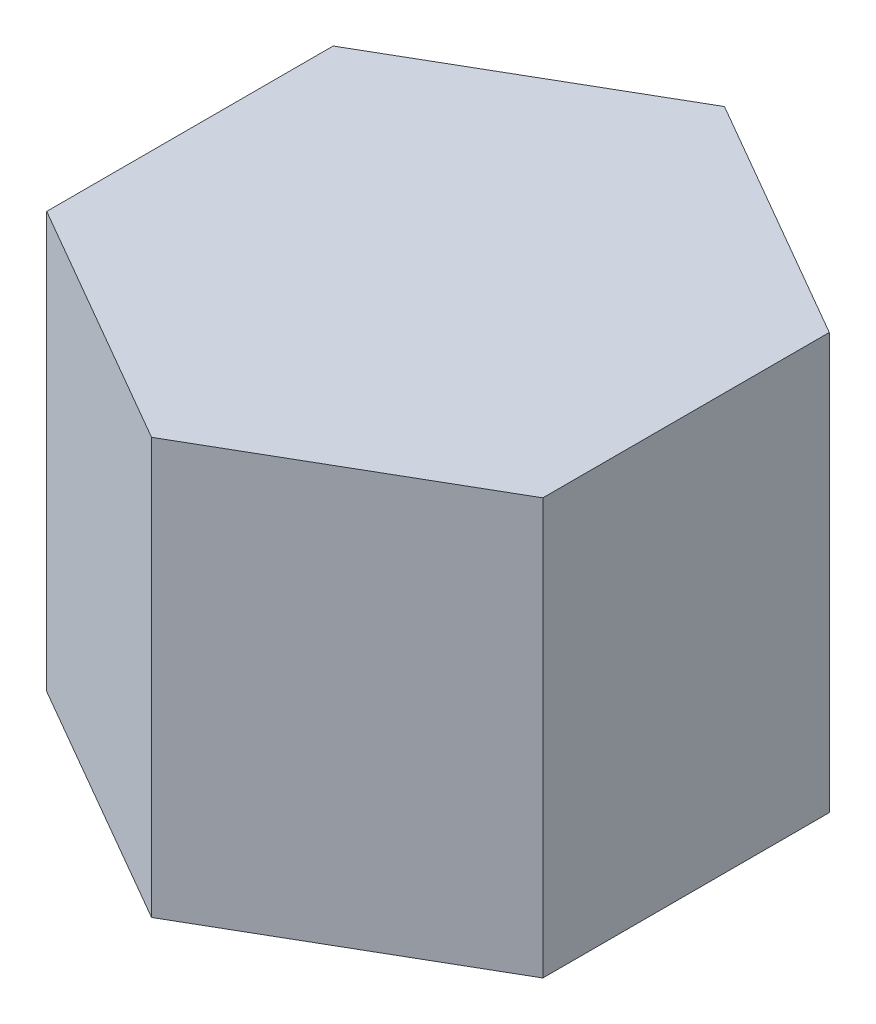
ISO-10303-21;
HEADER;
FILE_DESCRIPTION(('STEP AP214'),'2;1');
FILE_NAME('part.step','',(''),(''),'','','');
FILE_SCHEMA(('AUTOMOTIVE_DESIGN { 1 0 10303 214 1 1 1 1 }'));
ENDSEC;
DATA;
#1=APPLICATION_CONTEXT('core data for automotive mechanical design processes');
#2=APPLICATION_PROTOCOL_DEFINITION('international standard','automotive_design',2000,#1);
#3=PRODUCT_CONTEXT('',#1,'mechanical');
#4=PRODUCT('Part','Part','',(#3));
#5=PRODUCT_RELATED_PRODUCT_CATEGORY('part','',(#4));
#6=PRODUCT_DEFINITION_FORMATION('','',#4);
#7=PRODUCT_DEFINITION_CONTEXT('part definition',#1,'design');
#8=PRODUCT_DEFINITION('design','',#6,#7);
#9=PRODUCT_DEFINITION_SHAPE('','',#8);
#10=(LENGTH_UNIT() NAMED_UNIT(*) SI_UNIT(.MILLI.,.METRE.));
#11=(NAMED_UNIT(*) PLANE_ANGLE_UNIT() SI_UNIT($,.RADIAN.));
#12=(NAMED_UNIT(*) SI_UNIT($,.STERADIAN.) SOLID_ANGLE_UNIT());
#13=UNCERTAINTY_MEASURE_WITH_UNIT(LENGTH_MEASURE(1.E-05),#10,'distance_accuracy_value','');
#14=(GEOMETRIC_REPRESENTATION_CONTEXT(3) GLOBAL_UNCERTAINTY_ASSIGNED_CONTEXT((#13)) GLOBAL_UNIT_ASSIGNED_CONTEXT((#10,
#11,#12)) REPRESENTATION_CONTEXT('',''));
#15=CARTESIAN_POINT('',(0.,0.,0.));
#16=DIRECTION('',(0.,0.,1.));
#17=DIRECTION('',(1.,0.,0.));
#18=AXIS2_PLACEMENT_3D('',#15,#16,#17);
#19=CARTESIAN_POINT('',(208.642660308706,-148.537700895744,291.506971220494));
#20=DIRECTION('',(-0.499999999999909,0.,-0.866025403784491));
#21=DIRECTION('',(-0.866025403784491,0.,0.499999999999909));
#22=AXIS2_PLACEMENT_3D('',#19,#20,#21);
#23=PLANE('',#22);
#24=CARTESIAN_POINT('',(208.339551417382,-149.045793579175,291.681971220494));
#25=DIRECTION('',(0.866025403784491,0.,-0.499999999999909));
#26=VECTOR('',#25,1.);
#27=LINE('',#24,#26);
#28=CARTESIAN_POINT('',(208.339551417382,-149.045793579175,291.681971220494));
#29=VERTEX_POINT('',#28);
#30=CARTESIAN_POINT('',(208.642660308706,-149.045793579175,291.506971220494));
#31=VERTEX_POINT('',#30);
#32=EDGE_CURVE('E170',#29,#31,#27,.T.);
#33=ORIENTED_EDGE('',*,*,#32,.T.);
#34=CARTESIAN_POINT('',(208.642660308706,-148.537700895744,291.506971220494));
#35=DIRECTION('',(0.,-1.,0.));
#36=VECTOR('',#35,1.);
#37=LINE('',#34,#36);
#38=CARTESIAN_POINT('',(208.642660308706,-148.537700895744,291.506971220494));
#39=VERTEX_POINT('',#38);
#40=EDGE_CURVE('E35',#39,#31,#37,.T.);
#41=ORIENTED_EDGE('',*,*,#40,.F.);
#42=CARTESIAN_POINT('',(208.339551417382,-148.537700895744,291.681971220494));
#43=DIRECTION('',(0.866025403784491,0.,-0.499999999999909));
#44=VECTOR('',#43,1.);
#45=LINE('',#42,#44);
#46=CARTESIAN_POINT('',(208.339551417382,-148.537700895744,291.681971220494));
#47=VERTEX_POINT('',#46);
#48=EDGE_CURVE('E159',#47,#39,#45,.T.);
#49=ORIENTED_EDGE('',*,*,#48,.F.);
#50=CARTESIAN_POINT('',(208.339551417382,-148.537700895744,291.681971220494));
#51=DIRECTION('',(0.,-1.,0.));
#52=VECTOR('',#51,1.);
#53=LINE('',#50,#52);
#54=EDGE_CURVE('E10',#47,#29,#53,.T.);
#55=ORIENTED_EDGE('',*,*,#54,.T.);
#56=EDGE_LOOP('',(#33,#41,#49,#55));
#57=FACE_BOUND('',#56,.T.);
#58=ADVANCED_FACE('F16',(#57),#23,.F.);
#59=CARTESIAN_POINT('',(208.339551417382,-148.537700895744,291.681971220494));
#60=DIRECTION('',(0.500000000000096,0.,-0.866025403784383));
#61=DIRECTION('',(-0.866025403784383,0.,-0.500000000000096));
#62=AXIS2_PLACEMENT_3D('',#59,#60,#61);
#63=PLANE('',#62);
#64=CARTESIAN_POINT('',(208.036442526057,-149.045793579175,291.506971220494));
#65=DIRECTION('',(0.866025403784383,0.,0.500000000000096));
#66=VECTOR('',#65,1.);
#67=LINE('',#64,#66);
#68=CARTESIAN_POINT('',(208.036442526057,-149.045793579175,291.506971220494));
#69=VERTEX_POINT('',#68);
#70=EDGE_CURVE('E167',#69,#29,#67,.T.);
#71=ORIENTED_EDGE('',*,*,#70,.T.);
#72=ORIENTED_EDGE('',*,*,#54,.F.);
#73=CARTESIAN_POINT('',(208.036442526057,-148.537700895744,291.506971220494));
#74=DIRECTION('',(0.866025403784383,0.,0.500000000000096));
#75=VECTOR('',#74,1.);
#76=LINE('',#73,#75);
#77=CARTESIAN_POINT('',(208.036442526057,-148.537700895744,291.506971220494));
#78=VERTEX_POINT('',#77);
#79=EDGE_CURVE('E156',#78,#47,#76,.T.);
#80=ORIENTED_EDGE('',*,*,#79,.F.);
#81=CARTESIAN_POINT('',(208.036442526057,-148.537700895744,291.506971220494));
#82=DIRECTION('',(0.,-1.,0.));
#83=VECTOR('',#82,1.);
#84=LINE('',#81,#83);
#85=EDGE_CURVE('E27',#78,#69,#84,.T.);
#86=ORIENTED_EDGE('',*,*,#85,.T.);
#87=EDGE_LOOP('',(#71,#72,#80,#86));
#88=FACE_BOUND('',#87,.T.);
#89=ADVANCED_FACE('F189',(#88),#63,.F.);
#90=CARTESIAN_POINT('',(208.036442526057,-148.537700895744,290.831971220494));
#91=DIRECTION('',(1.,0.,0.));
#92=DIRECTION('',(0.,1.,0.));
#93=AXIS2_PLACEMENT_3D('',#90,#91,#92);
#94=PLANE('',#93);
#95=CARTESIAN_POINT('',(208.036442526057,-149.045793579175,291.156971220494));
#96=DIRECTION('',(0.,0.,1.));
#97=VECTOR('',#96,1.);
#98=LINE('',#95,#97);
#99=CARTESIAN_POINT('',(208.036442526057,-149.045793579175,291.156971220494));
#100=VERTEX_POINT('',#99);
#101=EDGE_CURVE('E163',#100,#69,#98,.T.);
#102=ORIENTED_EDGE('',*,*,#101,.T.);
#103=ORIENTED_EDGE('',*,*,#85,.F.);
#104=CARTESIAN_POINT('',(208.036442526057,-148.537700895744,291.156971220494));
#105=DIRECTION('',(0.,0.,1.));
#106=VECTOR('',#105,1.);
#107=LINE('',#104,#106);
#108=CARTESIAN_POINT('',(208.036442526057,-148.537700895744,291.156971220494));
#109=VERTEX_POINT('',#108);
#110=EDGE_CURVE('E106',#109,#78,#107,.T.);
#111=ORIENTED_EDGE('',*,*,#110,.F.);
#112=CARTESIAN_POINT('',(208.036442526057,-148.537700895744,291.156971220494));
#113=DIRECTION('',(0.,-1.,0.));
#114=VECTOR('',#113,1.);
#115=LINE('',#112,#114);
#116=EDGE_CURVE('E94',#109,#100,#115,.T.);
#117=ORIENTED_EDGE('',*,*,#116,.T.);
#118=EDGE_LOOP('',(#102,#103,#111,#117));
#119=FACE_BOUND('',#118,.T.);
#120=ADVANCED_FACE('F198',(#119),#94,.F.);
#121=CARTESIAN_POINT('',(208.036442526057,-148.537700895744,291.156971220494));
#122=DIRECTION('',(0.499999999999943,0.,0.866025403784472));
#123=DIRECTION('',(0.866025403784472,0.,-0.499999999999943));
#124=AXIS2_PLACEMENT_3D('',#121,#122,#123);
#125=PLANE('',#124);
#126=CARTESIAN_POINT('',(208.339551417382,-149.045793579175,290.981971220494));
#127=DIRECTION('',(-0.866025403784471,0.,0.499999999999943));
#128=VECTOR('',#127,1.);
#129=LINE('',#126,#128);
#130=CARTESIAN_POINT('',(208.339551417382,-149.045793579175,290.981971220494));
#131=VERTEX_POINT('',#130);
#132=EDGE_CURVE('E162',#131,#100,#129,.T.);
#133=ORIENTED_EDGE('',*,*,#132,.T.);
#134=ORIENTED_EDGE('',*,*,#116,.F.);
#135=CARTESIAN_POINT('',(208.339551417382,-148.537700895744,290.981971220494));
#136=DIRECTION('',(-0.866025403784471,0.,0.499999999999943));
#137=VECTOR('',#136,1.);
#138=LINE('',#135,#137);
#139=CARTESIAN_POINT('',(208.339551417382,-148.537700895744,290.981971220494));
#140=VERTEX_POINT('',#139);
#141=EDGE_CURVE('E98',#140,#109,#138,.T.);
#142=ORIENTED_EDGE('',*,*,#141,.F.);
#143=CARTESIAN_POINT('',(208.339551417382,-148.537700895744,290.981971220494));
#144=DIRECTION('',(0.,-1.,0.));
#145=VECTOR('',#144,1.);
#146=LINE('',#143,#145);
#147=EDGE_CURVE('E79',#140,#131,#146,.T.);
#148=ORIENTED_EDGE('',*,*,#147,.T.);
#149=EDGE_LOOP('',(#133,#134,#142,#148));
#150=FACE_BOUND('',#149,.T.);
#151=ADVANCED_FACE('F100',(#150),#125,.F.);
#152=CARTESIAN_POINT('',(208.339551417382,-148.537700895744,290.981971220494));
#153=DIRECTION('',(-0.500000000000062,0.,0.866025403784403));
#154=DIRECTION('',(0.866025403784403,0.,0.500000000000062));
#155=AXIS2_PLACEMENT_3D('',#152,#153,#154);
#156=PLANE('',#155);
#157=CARTESIAN_POINT('',(208.642660308706,-149.045793579175,291.156971220494));
#158=DIRECTION('',(-0.866025403784403,0.,-0.500000000000062));
#159=VECTOR('',#158,1.);
#160=LINE('',#157,#159);
#161=CARTESIAN_POINT('',(208.642660308706,-149.045793579175,291.156971220494));
#162=VERTEX_POINT('',#161);
#163=EDGE_CURVE('E88',#162,#131,#160,.T.);
#164=ORIENTED_EDGE('',*,*,#163,.T.);
#165=ORIENTED_EDGE('',*,*,#147,.F.);
#166=CARTESIAN_POINT('',(208.642660308706,-148.537700895744,291.156971220494));
#167=DIRECTION('',(-0.866025403784403,0.,-0.500000000000062));
#168=VECTOR('',#167,1.);
#169=LINE('',#166,#168);
#170=CARTESIAN_POINT('',(208.642660308706,-148.537700895744,291.156971220494));
#171=VERTEX_POINT('',#170);
#172=EDGE_CURVE('E84',#171,#140,#169,.T.);
#173=ORIENTED_EDGE('',*,*,#172,.F.);
#174=CARTESIAN_POINT('',(208.642660308706,-148.537700895744,291.156971220494));
#175=DIRECTION('',(0.,-1.,0.));
#176=VECTOR('',#175,1.);
#177=LINE('',#174,#176);
#178=EDGE_CURVE('E58',#171,#162,#177,.T.);
#179=ORIENTED_EDGE('',*,*,#178,.T.);
#180=EDGE_LOOP('',(#164,#165,#173,#179));
#181=FACE_BOUND('',#180,.T.);
#182=ADVANCED_FACE('F82',(#181),#156,.F.);
#183=CARTESIAN_POINT('',(208.642660308706,-148.537700895744,290.831971220494));
#184=DIRECTION('',(-1.,0.,0.));
#185=DIRECTION('',(0.,-1.,0.));
#186=AXIS2_PLACEMENT_3D('',#183,#184,#185);
#187=PLANE('',#186);
#188=CARTESIAN_POINT('',(208.642660308706,-149.045793579175,291.506971220494));
#189=DIRECTION('',(0.,0.,-1.));
#190=VECTOR('',#189,1.);
#191=LINE('',#188,#190);
#192=EDGE_CURVE('E160',#31,#162,#191,.T.);
#193=ORIENTED_EDGE('',*,*,#192,.T.);
#194=ORIENTED_EDGE('',*,*,#178,.F.);
#195=CARTESIAN_POINT('',(208.642660308706,-148.537700895744,291.506971220494));
#196=DIRECTION('',(0.,0.,-1.));
#197=VECTOR('',#196,1.);
#198=LINE('',#195,#197);
#199=EDGE_CURVE('E112',#39,#171,#198,.T.);
#200=ORIENTED_EDGE('',*,*,#199,.F.);
#201=ORIENTED_EDGE('',*,*,#40,.T.);
#202=EDGE_LOOP('',(#193,#194,#200,#201));
#203=FACE_BOUND('',#202,.T.);
#204=ADVANCED_FACE('F131',(#203),#187,.F.);
#205=CARTESIAN_POINT('',(206.339551417382,-148.537700895744,290.831971220494));
#206=DIRECTION('',(0.,-1.,0.));
#207=DIRECTION('',(1.,0.,0.));
#208=AXIS2_PLACEMENT_3D('',#205,#206,#207);
#209=PLANE('',#208);
#210=ORIENTED_EDGE('',*,*,#48,.T.);
#211=ORIENTED_EDGE('',*,*,#199,.T.);
#212=ORIENTED_EDGE('',*,*,#172,.T.);
#213=ORIENTED_EDGE('',*,*,#141,.T.);
#214=ORIENTED_EDGE('',*,*,#110,.T.);
#215=ORIENTED_EDGE('',*,*,#79,.T.);
#216=EDGE_LOOP('',(#210,#211,#212,#213,#214,#215));
#217=FACE_BOUND('',#216,.T.);
#218=ADVANCED_FACE('F111',(#217),#209,.F.);
#219=CARTESIAN_POINT('',(206.339551417382,-149.045793579175,290.831971220494));
#220=DIRECTION('',(0.,-1.,0.));
#221=DIRECTION('',(1.,0.,0.));
#222=AXIS2_PLACEMENT_3D('',#219,#220,#221);
#223=PLANE('',#222);
#224=ORIENTED_EDGE('',*,*,#32,.F.);
#225=ORIENTED_EDGE('',*,*,#70,.F.);
#226=ORIENTED_EDGE('',*,*,#101,.F.);
#227=ORIENTED_EDGE('',*,*,#132,.F.);
#228=ORIENTED_EDGE('',*,*,#163,.F.);
#229=ORIENTED_EDGE('',*,*,#192,.F.);
#230=EDGE_LOOP('',(#224,#225,#226,#227,#228,#229));
#231=FACE_BOUND('',#230,.T.);
#232=ADVANCED_FACE('F130',(#231),#223,.T.);
#233=CLOSED_SHELL('',(#58,#89,#120,#151,#182,#204,#218,#232));
#234=MANIFOLD_SOLID_BREP('B1',#233);
#235=ADVANCED_BREP_SHAPE_REPRESENTATION('',(#18,#234),#14);
#236=SHAPE_DEFINITION_REPRESENTATION(#9,#235);
ENDSEC;
END-ISO-10303-21;
